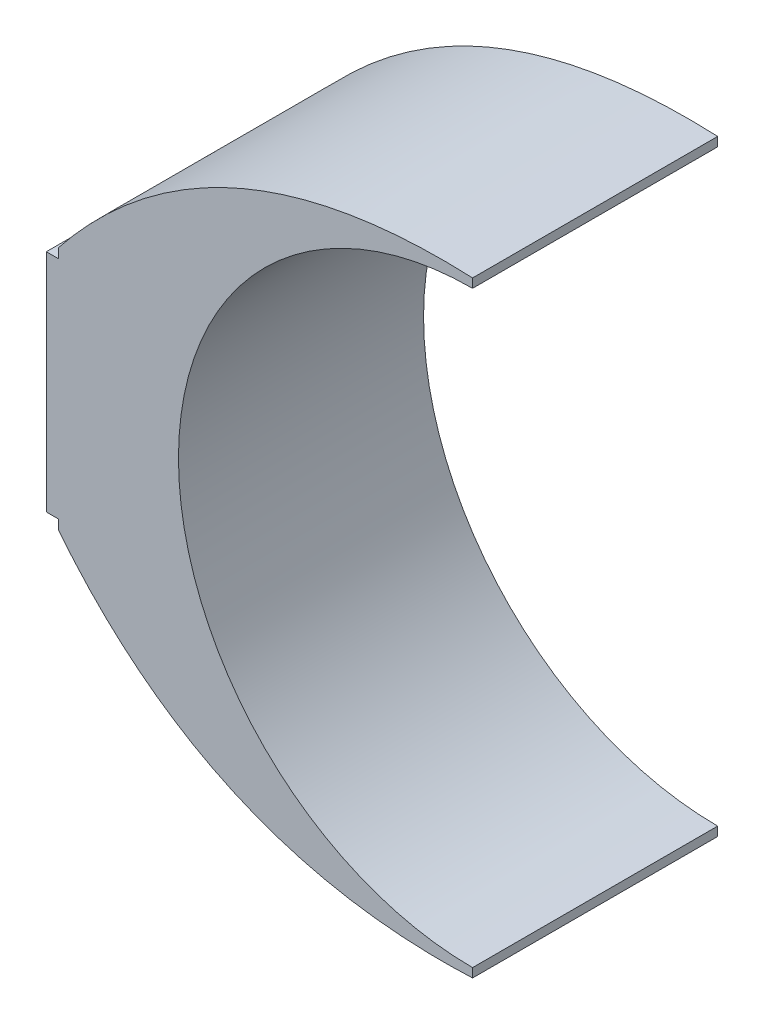
ISO-10303-21;
HEADER;
FILE_DESCRIPTION(('STEP AP214'),'2;1');
FILE_NAME('part.step','',(''),(''),'','','');
FILE_SCHEMA(('AUTOMOTIVE_DESIGN { 1 0 10303 214 1 1 1 1 }'));
ENDSEC;
DATA;
#1=APPLICATION_CONTEXT('core data for automotive mechanical design processes');
#2=APPLICATION_PROTOCOL_DEFINITION('international standard','automotive_design',2000,#1);
#3=PRODUCT_CONTEXT('',#1,'mechanical');
#4=PRODUCT('Part','Part','',(#3));
#5=PRODUCT_RELATED_PRODUCT_CATEGORY('part','',(#4));
#6=PRODUCT_DEFINITION_FORMATION('','',#4);
#7=PRODUCT_DEFINITION_CONTEXT('part definition',#1,'design');
#8=PRODUCT_DEFINITION('design','',#6,#7);
#9=PRODUCT_DEFINITION_SHAPE('','',#8);
#10=(LENGTH_UNIT() NAMED_UNIT(*) SI_UNIT(.MILLI.,.METRE.));
#11=(NAMED_UNIT(*) PLANE_ANGLE_UNIT() SI_UNIT($,.RADIAN.));
#12=(NAMED_UNIT(*) SI_UNIT($,.STERADIAN.) SOLID_ANGLE_UNIT());
#13=UNCERTAINTY_MEASURE_WITH_UNIT(LENGTH_MEASURE(1.E-05),#10,'distance_accuracy_value','');
#14=(GEOMETRIC_REPRESENTATION_CONTEXT(3) GLOBAL_UNCERTAINTY_ASSIGNED_CONTEXT((#13)) GLOBAL_UNIT_ASSIGNED_CONTEXT((#10,
#11,#12)) REPRESENTATION_CONTEXT('',''));
#15=CARTESIAN_POINT('',(0.,0.,0.));
#16=DIRECTION('',(0.,0.,1.));
#17=DIRECTION('',(1.,0.,0.));
#18=AXIS2_PLACEMENT_3D('',#15,#16,#17);
#19=CARTESIAN_POINT('',(4.11502641064353,2.17734350082173,2.));
#20=CARTESIAN_POINT('',(1.98664509502349,2.27340837180248,2.));
#21=CARTESIAN_POINT('',(0.736711976385715,0.702903059855344,2.));
#22=B_SPLINE_CURVE_WITH_KNOTS('',2,(#19,#20,#21),.UNSPECIFIED.,.F.,.F.,(3,3),(0.,1.),.UNSPECIFIED.);
#23=DIRECTION('',(0.,0.,-1.));
#24=VECTOR('',#23,1.);
#25=SURFACE_OF_LINEAR_EXTRUSION('',#22,#24);
#26=CARTESIAN_POINT('',(4.11502641064353,2.17734350082173,0.));
#27=CARTESIAN_POINT('',(1.98664509502349,2.27340837180248,0.));
#28=CARTESIAN_POINT('',(0.736711976385715,0.702903059855344,0.));
#29=B_SPLINE_CURVE_WITH_KNOTS('',2,(#26,#27,#28),.UNSPECIFIED.,.F.,.F.,(3,3),(0.,1.),.UNSPECIFIED.);
#30=CARTESIAN_POINT('',(4.11502641064353,2.17734350082173,0.));
#31=VERTEX_POINT('',#30);
#32=CARTESIAN_POINT('',(0.736711976385715,0.702903059855344,0.));
#33=VERTEX_POINT('',#32);
#34=EDGE_CURVE('E145',#31,#33,#29,.T.);
#35=ORIENTED_EDGE('',*,*,#34,.T.);
#36=DIRECTION('',(0.,0.,-1.));
#37=VECTOR('',#36,1.);
#38=CARTESIAN_POINT('',(0.736711976385715,0.702903059855344,2.));
#39=LINE('',#38,#37);
#40=CARTESIAN_POINT('',(0.736711976385715,0.702903059855344,2.));
#41=VERTEX_POINT('',#40);
#42=EDGE_CURVE('E11',#41,#33,#39,.T.);
#43=ORIENTED_EDGE('',*,*,#42,.F.);
#44=CARTESIAN_POINT('',(4.11502641064353,2.17734350082173,2.));
#45=VERTEX_POINT('',#44);
#46=EDGE_CURVE('E173',#45,#41,#22,.T.);
#47=ORIENTED_EDGE('',*,*,#46,.F.);
#48=DIRECTION('',(0.,0.,-1.));
#49=VECTOR('',#48,1.);
#50=CARTESIAN_POINT('',(4.11502641064353,2.17734350082173,2.));
#51=LINE('',#50,#49);
#52=EDGE_CURVE('E141',#45,#31,#51,.T.);
#53=ORIENTED_EDGE('',*,*,#52,.T.);
#54=EDGE_LOOP('',(#35,#43,#47,#53));
#55=FACE_BOUND('',#54,.T.);
#56=ADVANCED_FACE('F36',(#55),#25,.F.);
#57=CARTESIAN_POINT('',(0.736711976385715,0.623374659543873,2.));
#58=DIRECTION('',(1.,0.,0.));
#59=DIRECTION('',(0.,0.,-1.));
#60=AXIS2_PLACEMENT_3D('',#57,#58,#59);
#61=PLANE('',#60);
#62=DIRECTION('',(0.,-1.,0.));
#63=VECTOR('',#62,1.);
#64=CARTESIAN_POINT('',(0.736711976385715,0.623374659543873,0.));
#65=LINE('',#64,#63);
#66=CARTESIAN_POINT('',(0.736711976385715,0.623374659543873,0.));
#67=VERTEX_POINT('',#66);
#68=EDGE_CURVE('E150',#33,#67,#65,.T.);
#69=ORIENTED_EDGE('',*,*,#68,.T.);
#70=DIRECTION('',(0.,0.,-1.));
#71=VECTOR('',#70,1.);
#72=CARTESIAN_POINT('',(0.736711976385715,0.623374659543873,2.));
#73=LINE('',#72,#71);
#74=CARTESIAN_POINT('',(0.736711976385715,0.623374659543873,2.));
#75=VERTEX_POINT('',#74);
#76=EDGE_CURVE('E45',#75,#67,#73,.T.);
#77=ORIENTED_EDGE('',*,*,#76,.F.);
#78=DIRECTION('',(0.,-1.,0.));
#79=VECTOR('',#78,1.);
#80=CARTESIAN_POINT('',(0.736711976385715,0.623374659543873,2.));
#81=LINE('',#80,#79);
#82=EDGE_CURVE('E102',#41,#75,#81,.T.);
#83=ORIENTED_EDGE('',*,*,#82,.F.);
#84=ORIENTED_EDGE('',*,*,#42,.T.);
#85=EDGE_LOOP('',(#69,#77,#83,#84));
#86=FACE_BOUND('',#85,.T.);
#87=ADVANCED_FACE('F239',(#86),#61,.F.);
#88=CARTESIAN_POINT('',(0.636711976385715,0.623374659543873,2.));
#89=DIRECTION('',(0.,-1.,0.));
#90=DIRECTION('',(0.,0.,-1.));
#91=AXIS2_PLACEMENT_3D('',#88,#89,#90);
#92=PLANE('',#91);
#93=DIRECTION('',(-1.,0.,0.));
#94=VECTOR('',#93,1.);
#95=CARTESIAN_POINT('',(0.636711976385715,0.623374659543873,0.));
#96=LINE('',#95,#94);
#97=CARTESIAN_POINT('',(0.636711976385715,0.623374659543873,0.));
#98=VERTEX_POINT('',#97);
#99=EDGE_CURVE('E155',#67,#98,#96,.T.);
#100=ORIENTED_EDGE('',*,*,#99,.T.);
#101=DIRECTION('',(0.,0.,-1.));
#102=VECTOR('',#101,1.);
#103=CARTESIAN_POINT('',(0.636711976385715,0.623374659543873,2.));
#104=LINE('',#103,#102);
#105=CARTESIAN_POINT('',(0.636711976385715,0.623374659543873,2.));
#106=VERTEX_POINT('',#105);
#107=EDGE_CURVE('E186',#106,#98,#104,.T.);
#108=ORIENTED_EDGE('',*,*,#107,.F.);
#109=DIRECTION('',(-1.,0.,0.));
#110=VECTOR('',#109,1.);
#111=CARTESIAN_POINT('',(0.636711976385715,0.623374659543873,2.));
#112=LINE('',#111,#110);
#113=EDGE_CURVE('E194',#75,#106,#112,.T.);
#114=ORIENTED_EDGE('',*,*,#113,.F.);
#115=ORIENTED_EDGE('',*,*,#76,.T.);
#116=EDGE_LOOP('',(#100,#108,#114,#115));
#117=FACE_BOUND('',#116,.T.);
#118=ADVANCED_FACE('F192',(#117),#92,.F.);
#119=CARTESIAN_POINT('',(0.636711976385715,0.623374659543873,2.));
#120=DIRECTION('',(1.,0.,0.));
#121=DIRECTION('',(0.,1.,0.));
#122=AXIS2_PLACEMENT_3D('',#119,#120,#121);
#123=PLANE('',#122);
#124=DIRECTION('',(0.,-1.,0.));
#125=VECTOR('',#124,1.);
#126=CARTESIAN_POINT('',(0.636711976385715,0.623374659543873,0.));
#127=LINE('',#126,#125);
#128=CARTESIAN_POINT('',(0.636711976385716,-1.21589445222173,0.));
#129=VERTEX_POINT('',#128);
#130=EDGE_CURVE('E157',#98,#129,#127,.T.);
#131=ORIENTED_EDGE('',*,*,#130,.T.);
#132=DIRECTION('',(0.,0.,-1.));
#133=VECTOR('',#132,1.);
#134=CARTESIAN_POINT('',(0.636711976385716,-1.21589445222173,2.));
#135=LINE('',#134,#133);
#136=CARTESIAN_POINT('',(0.636711976385716,-1.21589445222173,2.));
#137=VERTEX_POINT('',#136);
#138=EDGE_CURVE('E183',#137,#129,#135,.T.);
#139=ORIENTED_EDGE('',*,*,#138,.F.);
#140=DIRECTION('',(0.,-1.,0.));
#141=VECTOR('',#140,1.);
#142=CARTESIAN_POINT('',(0.636711976385715,0.623374659543873,2.));
#143=LINE('',#142,#141);
#144=EDGE_CURVE('E212',#106,#137,#143,.T.);
#145=ORIENTED_EDGE('',*,*,#144,.F.);
#146=ORIENTED_EDGE('',*,*,#107,.T.);
#147=EDGE_LOOP('',(#131,#139,#145,#146));
#148=FACE_BOUND('',#147,.T.);
#149=ADVANCED_FACE('F203',(#148),#123,.F.);
#150=CARTESIAN_POINT('',(0.636711976385716,-1.21589445222173,2.));
#151=DIRECTION('',(0.,1.,0.));
#152=DIRECTION('',(0.,0.,1.));
#153=AXIS2_PLACEMENT_3D('',#150,#151,#152);
#154=PLANE('',#153);
#155=DIRECTION('',(1.,0.,0.));
#156=VECTOR('',#155,1.);
#157=CARTESIAN_POINT('',(0.636711976385716,-1.21589445222173,0.));
#158=LINE('',#157,#156);
#159=CARTESIAN_POINT('',(0.736711976385716,-1.21589445222173,0.));
#160=VERTEX_POINT('',#159);
#161=EDGE_CURVE('E159',#129,#160,#158,.T.);
#162=ORIENTED_EDGE('',*,*,#161,.T.);
#163=DIRECTION('',(0.,0.,-1.));
#164=VECTOR('',#163,1.);
#165=CARTESIAN_POINT('',(0.736711976385716,-1.21589445222173,2.));
#166=LINE('',#165,#164);
#167=CARTESIAN_POINT('',(0.736711976385716,-1.21589445222173,2.));
#168=VERTEX_POINT('',#167);
#169=EDGE_CURVE('E180',#168,#160,#166,.T.);
#170=ORIENTED_EDGE('',*,*,#169,.F.);
#171=DIRECTION('',(1.,0.,0.));
#172=VECTOR('',#171,1.);
#173=CARTESIAN_POINT('',(0.636711976385716,-1.21589445222173,2.));
#174=LINE('',#173,#172);
#175=EDGE_CURVE('E209',#137,#168,#174,.T.);
#176=ORIENTED_EDGE('',*,*,#175,.F.);
#177=ORIENTED_EDGE('',*,*,#138,.T.);
#178=EDGE_LOOP('',(#162,#170,#176,#177));
#179=FACE_BOUND('',#178,.T.);
#180=ADVANCED_FACE('F207',(#179),#154,.F.);
#181=CARTESIAN_POINT('',(0.736711976385716,-1.21589445222173,2.));
#182=DIRECTION('',(1.,0.,0.));
#183=DIRECTION('',(0.,0.,-1.));
#184=AXIS2_PLACEMENT_3D('',#181,#182,#183);
#185=PLANE('',#184);
#186=DIRECTION('',(0.,-1.,0.));
#187=VECTOR('',#186,1.);
#188=CARTESIAN_POINT('',(0.736711976385716,-1.21589445222173,0.));
#189=LINE('',#188,#187);
#190=CARTESIAN_POINT('',(0.736711976385716,-1.2954228525332,0.));
#191=VERTEX_POINT('',#190);
#192=EDGE_CURVE('E161',#160,#191,#189,.T.);
#193=ORIENTED_EDGE('',*,*,#192,.T.);
#194=DIRECTION('',(0.,0.,-1.));
#195=VECTOR('',#194,1.);
#196=CARTESIAN_POINT('',(0.736711976385716,-1.2954228525332,2.));
#197=LINE('',#196,#195);
#198=CARTESIAN_POINT('',(0.736711976385716,-1.2954228525332,2.));
#199=VERTEX_POINT('',#198);
#200=EDGE_CURVE('E177',#199,#191,#197,.T.);
#201=ORIENTED_EDGE('',*,*,#200,.F.);
#202=DIRECTION('',(0.,-1.,0.));
#203=VECTOR('',#202,1.);
#204=CARTESIAN_POINT('',(0.736711976385716,-1.21589445222173,2.));
#205=LINE('',#204,#203);
#206=EDGE_CURVE('E211',#168,#199,#205,.T.);
#207=ORIENTED_EDGE('',*,*,#206,.F.);
#208=ORIENTED_EDGE('',*,*,#169,.T.);
#209=EDGE_LOOP('',(#193,#201,#207,#208));
#210=FACE_BOUND('',#209,.T.);
#211=ADVANCED_FACE('F228',(#210),#185,.F.);
#212=CARTESIAN_POINT('',(0.736711976385716,-1.2954228525332,2.));
#213=CARTESIAN_POINT('',(1.98664509502349,-2.86592816448033,2.));
#214=CARTESIAN_POINT('',(4.11502641064353,-2.76986329349958,2.));
#215=B_SPLINE_CURVE_WITH_KNOTS('',2,(#212,#213,#214),.UNSPECIFIED.,.F.,.F.,(3,3),(0.,1.),.UNSPECIFIED.);
#216=DIRECTION('',(0.,0.,-1.));
#217=VECTOR('',#216,1.);
#218=SURFACE_OF_LINEAR_EXTRUSION('',#215,#217);
#219=CARTESIAN_POINT('',(0.736711976385716,-1.2954228525332,0.));
#220=CARTESIAN_POINT('',(1.98664509502349,-2.86592816448033,0.));
#221=CARTESIAN_POINT('',(4.11502641064353,-2.76986329349958,0.));
#222=B_SPLINE_CURVE_WITH_KNOTS('',2,(#219,#220,#221),.UNSPECIFIED.,.F.,.F.,(3,3),(0.,1.),.UNSPECIFIED.);
#223=CARTESIAN_POINT('',(4.11502641064353,-2.76986329349958,0.));
#224=VERTEX_POINT('',#223);
#225=EDGE_CURVE('E163',#191,#224,#222,.T.);
#226=ORIENTED_EDGE('',*,*,#225,.T.);
#227=DIRECTION('',(0.,0.,-1.));
#228=VECTOR('',#227,1.);
#229=CARTESIAN_POINT('',(4.11502641064353,-2.76986329349958,2.));
#230=LINE('',#229,#228);
#231=CARTESIAN_POINT('',(4.11502641064353,-2.76986329349958,2.));
#232=VERTEX_POINT('',#231);
#233=EDGE_CURVE('E136',#232,#224,#230,.T.);
#234=ORIENTED_EDGE('',*,*,#233,.F.);
#235=EDGE_CURVE('E127',#199,#232,#215,.T.);
#236=ORIENTED_EDGE('',*,*,#235,.F.);
#237=ORIENTED_EDGE('',*,*,#200,.T.);
#238=EDGE_LOOP('',(#226,#234,#236,#237));
#239=FACE_BOUND('',#238,.T.);
#240=ADVANCED_FACE('F224',(#239),#218,.F.);
#241=CARTESIAN_POINT('',(4.11502641064353,-2.76986329349958,2.));
#242=DIRECTION('',(-1.,0.,0.));
#243=DIRECTION('',(0.,0.,1.));
#244=AXIS2_PLACEMENT_3D('',#241,#242,#243);
#245=PLANE('',#244);
#246=DIRECTION('',(0.,1.,0.));
#247=VECTOR('',#246,1.);
#248=CARTESIAN_POINT('',(4.11502641064353,-2.76986329349958,0.));
#249=LINE('',#248,#247);
#250=CARTESIAN_POINT('',(4.11502641064353,-2.69625989633893,0.));
#251=VERTEX_POINT('',#250);
#252=EDGE_CURVE('E135',#224,#251,#249,.T.);
#253=ORIENTED_EDGE('',*,*,#252,.T.);
#254=DIRECTION('',(0.,0.,-1.));
#255=VECTOR('',#254,1.);
#256=CARTESIAN_POINT('',(4.11502641064353,-2.69625989633893,2.));
#257=LINE('',#256,#255);
#258=CARTESIAN_POINT('',(4.11502641064353,-2.69625989633893,2.));
#259=VERTEX_POINT('',#258);
#260=EDGE_CURVE('E132',#259,#251,#257,.T.);
#261=ORIENTED_EDGE('',*,*,#260,.F.);
#262=DIRECTION('',(0.,1.,0.));
#263=VECTOR('',#262,1.);
#264=CARTESIAN_POINT('',(4.11502641064353,-2.76986329349958,2.));
#265=LINE('',#264,#263);
#266=EDGE_CURVE('E121',#232,#259,#265,.T.);
#267=ORIENTED_EDGE('',*,*,#266,.F.);
#268=ORIENTED_EDGE('',*,*,#233,.T.);
#269=EDGE_LOOP('',(#253,#261,#267,#268));
#270=FACE_BOUND('',#269,.T.);
#271=ADVANCED_FACE('F133',(#270),#245,.F.);
#272=CARTESIAN_POINT('',(4.11502641064353,-0.296259896338927,2.));
#273=DIRECTION('',(0.,0.,-1.));
#274=DIRECTION('',(-1.,0.,0.));
#275=AXIS2_PLACEMENT_3D('',#272,#273,#274);
#276=CYLINDRICAL_SURFACE('',#275,2.4);
#277=CARTESIAN_POINT('',(4.11502641064353,-0.296259896338927,0.));
#278=DIRECTION('',(0.,0.,-1.));
#279=DIRECTION('',(1.,0.,0.));
#280=AXIS2_PLACEMENT_3D('',#277,#278,#279);
#281=CIRCLE('',#280,2.4);
#282=CARTESIAN_POINT('',(4.11502641064353,2.10374010366107,0.));
#283=VERTEX_POINT('',#282);
#284=EDGE_CURVE('E88',#251,#283,#281,.T.);
#285=ORIENTED_EDGE('',*,*,#284,.T.);
#286=DIRECTION('',(0.,0.,-1.));
#287=VECTOR('',#286,1.);
#288=CARTESIAN_POINT('',(4.11502641064353,2.10374010366107,2.));
#289=LINE('',#288,#287);
#290=CARTESIAN_POINT('',(4.11502641064353,2.10374010366107,2.));
#291=VERTEX_POINT('',#290);
#292=EDGE_CURVE('E137',#291,#283,#289,.T.);
#293=ORIENTED_EDGE('',*,*,#292,.F.);
#294=CARTESIAN_POINT('',(4.11502641064353,-0.296259896338927,2.));
#295=DIRECTION('',(0.,0.,-1.));
#296=DIRECTION('',(1.,0.,0.));
#297=AXIS2_PLACEMENT_3D('',#294,#295,#296);
#298=CIRCLE('',#297,2.4);
#299=EDGE_CURVE('E125',#259,#291,#298,.T.);
#300=ORIENTED_EDGE('',*,*,#299,.F.);
#301=ORIENTED_EDGE('',*,*,#260,.T.);
#302=EDGE_LOOP('',(#285,#293,#300,#301));
#303=FACE_BOUND('',#302,.T.);
#304=ADVANCED_FACE('F139',(#303),#276,.F.);
#305=CARTESIAN_POINT('',(4.11502641064353,2.17734350082173,2.));
#306=DIRECTION('',(-1.,0.,0.));
#307=DIRECTION('',(0.,0.,1.));
#308=AXIS2_PLACEMENT_3D('',#305,#306,#307);
#309=PLANE('',#308);
#310=DIRECTION('',(0.,1.,0.));
#311=VECTOR('',#310,1.);
#312=CARTESIAN_POINT('',(4.11502641064353,2.17734350082173,0.));
#313=LINE('',#312,#311);
#314=EDGE_CURVE('E94',#283,#31,#313,.T.);
#315=ORIENTED_EDGE('',*,*,#314,.T.);
#316=ORIENTED_EDGE('',*,*,#52,.F.);
#317=DIRECTION('',(0.,1.,0.));
#318=VECTOR('',#317,1.);
#319=CARTESIAN_POINT('',(4.11502641064353,2.17734350082173,2.));
#320=LINE('',#319,#318);
#321=EDGE_CURVE('E53',#291,#45,#320,.T.);
#322=ORIENTED_EDGE('',*,*,#321,.F.);
#323=ORIENTED_EDGE('',*,*,#292,.T.);
#324=EDGE_LOOP('',(#315,#316,#322,#323));
#325=FACE_BOUND('',#324,.T.);
#326=ADVANCED_FACE('F249',(#325),#309,.F.);
#327=CARTESIAN_POINT('',(2.20625714426906,1.85676582607051,2.));
#328=DIRECTION('',(0.,0.,-1.));
#329=DIRECTION('',(-1.,0.,0.));
#330=AXIS2_PLACEMENT_3D('',#327,#328,#329);
#331=PLANE('',#330);
#332=ORIENTED_EDGE('',*,*,#46,.T.);
#333=ORIENTED_EDGE('',*,*,#82,.T.);
#334=ORIENTED_EDGE('',*,*,#113,.T.);
#335=ORIENTED_EDGE('',*,*,#144,.T.);
#336=ORIENTED_EDGE('',*,*,#175,.T.);
#337=ORIENTED_EDGE('',*,*,#206,.T.);
#338=ORIENTED_EDGE('',*,*,#235,.T.);
#339=ORIENTED_EDGE('',*,*,#266,.T.);
#340=ORIENTED_EDGE('',*,*,#299,.T.);
#341=ORIENTED_EDGE('',*,*,#321,.T.);
#342=EDGE_LOOP('',(#332,#333,#334,#335,#336,#337,#338,#339,#340,#341));
#343=FACE_BOUND('',#342,.T.);
#344=ADVANCED_FACE('F123',(#343),#331,.F.);
#345=CARTESIAN_POINT('',(2.20625714426906,1.85676582607051,0.));
#346=DIRECTION('',(0.,0.,-1.));
#347=DIRECTION('',(-1.,0.,0.));
#348=AXIS2_PLACEMENT_3D('',#345,#346,#347);
#349=PLANE('',#348);
#350=ORIENTED_EDGE('',*,*,#34,.F.);
#351=ORIENTED_EDGE('',*,*,#314,.F.);
#352=ORIENTED_EDGE('',*,*,#284,.F.);
#353=ORIENTED_EDGE('',*,*,#252,.F.);
#354=ORIENTED_EDGE('',*,*,#225,.F.);
#355=ORIENTED_EDGE('',*,*,#192,.F.);
#356=ORIENTED_EDGE('',*,*,#161,.F.);
#357=ORIENTED_EDGE('',*,*,#130,.F.);
#358=ORIENTED_EDGE('',*,*,#99,.F.);
#359=ORIENTED_EDGE('',*,*,#68,.F.);
#360=EDGE_LOOP('',(#350,#351,#352,#353,#354,#355,#356,#357,#358,#359));
#361=FACE_BOUND('',#360,.T.);
#362=ADVANCED_FACE('F198',(#361),#349,.T.);
#363=CLOSED_SHELL('',(#56,#87,#118,#149,#180,#211,#240,#271,#304,#326,#344,#362));
#364=MANIFOLD_SOLID_BREP('B2',#363);
#365=ADVANCED_BREP_SHAPE_REPRESENTATION('',(#18,#364),#14);
#366=SHAPE_DEFINITION_REPRESENTATION(#9,#365);
ENDSEC;
END-ISO-10303-21;
